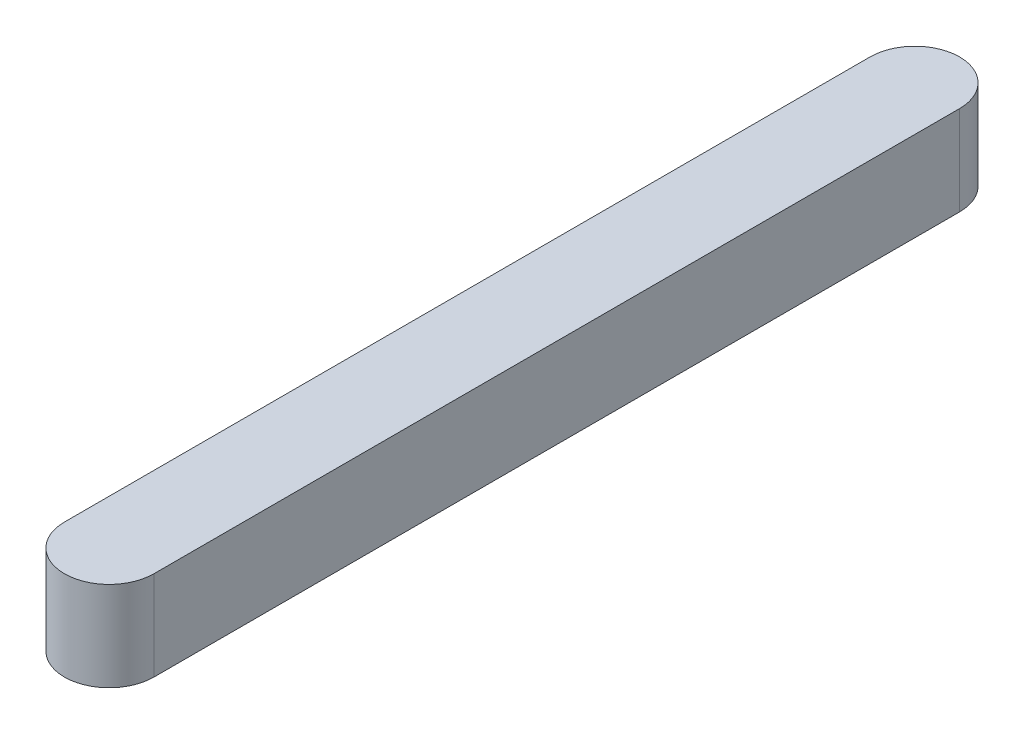
ISO-10303-21;
HEADER;
FILE_DESCRIPTION(('STEP AP214'),'2;1');
FILE_NAME('part.step','',(''),(''),'','','');
FILE_SCHEMA(('AUTOMOTIVE_DESIGN { 1 0 10303 214 1 1 1 1 }'));
ENDSEC;
DATA;
#1=APPLICATION_CONTEXT('core data for automotive mechanical design processes');
#2=APPLICATION_PROTOCOL_DEFINITION('international standard','automotive_design',2000,#1);
#3=PRODUCT_CONTEXT('',#1,'mechanical');
#4=PRODUCT('Part','Part','',(#3));
#5=PRODUCT_RELATED_PRODUCT_CATEGORY('part','',(#4));
#6=PRODUCT_DEFINITION_FORMATION('','',#4);
#7=PRODUCT_DEFINITION_CONTEXT('part definition',#1,'design');
#8=PRODUCT_DEFINITION('design','',#6,#7);
#9=PRODUCT_DEFINITION_SHAPE('','',#8);
#10=(LENGTH_UNIT() NAMED_UNIT(*) SI_UNIT(.MILLI.,.METRE.));
#11=(NAMED_UNIT(*) PLANE_ANGLE_UNIT() SI_UNIT($,.RADIAN.));
#12=(NAMED_UNIT(*) SI_UNIT($,.STERADIAN.) SOLID_ANGLE_UNIT());
#13=UNCERTAINTY_MEASURE_WITH_UNIT(LENGTH_MEASURE(1.E-05),#10,'distance_accuracy_value','');
#14=(GEOMETRIC_REPRESENTATION_CONTEXT(3) GLOBAL_UNCERTAINTY_ASSIGNED_CONTEXT((#13)) GLOBAL_UNIT_ASSIGNED_CONTEXT((#10,
#11,#12)) REPRESENTATION_CONTEXT('',''));
#15=CARTESIAN_POINT('',(0.,0.,0.));
#16=DIRECTION('',(0.,0.,1.));
#17=DIRECTION('',(1.,0.,0.));
#18=AXIS2_PLACEMENT_3D('',#15,#16,#17);
#19=CARTESIAN_POINT('',(0.,1.,9.));
#20=DIRECTION('',(0.,-1.,0.));
#21=DIRECTION('',(0.,0.,-1.));
#22=AXIS2_PLACEMENT_3D('',#19,#20,#21);
#23=CYLINDRICAL_SURFACE('',#22,1.);
#24=CARTESIAN_POINT('',(0.,-1.,9.));
#25=DIRECTION('',(0.,-1.,0.));
#26=DIRECTION('',(0.,0.,-1.));
#27=AXIS2_PLACEMENT_3D('',#24,#25,#26);
#28=CIRCLE('',#27,1.);
#29=CARTESIAN_POINT('',(-1.,-1.,9.));
#30=VERTEX_POINT('',#29);
#31=CARTESIAN_POINT('',(1.,-1.,9.));
#32=VERTEX_POINT('',#31);
#33=EDGE_CURVE('E20',#30,#32,#28,.F.);
#34=ORIENTED_EDGE('',*,*,#33,.T.);
#35=DIRECTION('',(0.,1.,0.));
#36=VECTOR('',#35,1.);
#37=CARTESIAN_POINT('',(1.,-1.,9.));
#38=LINE('',#37,#36);
#39=CARTESIAN_POINT('',(1.,1.,9.));
#40=VERTEX_POINT('',#39);
#41=EDGE_CURVE('E76',#32,#40,#38,.T.);
#42=ORIENTED_EDGE('',*,*,#41,.T.);
#43=CARTESIAN_POINT('',(0.,1.,9.));
#44=DIRECTION('',(0.,-1.,0.));
#45=DIRECTION('',(0.,0.,-1.));
#46=AXIS2_PLACEMENT_3D('',#43,#44,#45);
#47=CIRCLE('',#46,1.);
#48=CARTESIAN_POINT('',(-1.,1.,9.));
#49=VERTEX_POINT('',#48);
#50=EDGE_CURVE('E64',#40,#49,#47,.T.);
#51=ORIENTED_EDGE('',*,*,#50,.T.);
#52=DIRECTION('',(0.,1.,0.));
#53=VECTOR('',#52,1.);
#54=CARTESIAN_POINT('',(-1.,-1.,9.));
#55=LINE('',#54,#53);
#56=EDGE_CURVE('E83',#49,#30,#55,.F.);
#57=ORIENTED_EDGE('',*,*,#56,.T.);
#58=EDGE_LOOP('',(#34,#42,#51,#57));
#59=FACE_BOUND('',#58,.T.);
#60=ADVANCED_FACE('F17',(#59),#23,.T.);
#61=CARTESIAN_POINT('',(0.,-1.,-9.));
#62=DIRECTION('',(0.,1.,0.));
#63=DIRECTION('',(0.,0.,1.));
#64=AXIS2_PLACEMENT_3D('',#61,#62,#63);
#65=CYLINDRICAL_SURFACE('',#64,0.999999999999999);
#66=CARTESIAN_POINT('',(0.,-1.,-9.));
#67=DIRECTION('',(0.,1.,0.));
#68=DIRECTION('',(0.,0.,1.));
#69=AXIS2_PLACEMENT_3D('',#66,#67,#68);
#70=CIRCLE('',#69,0.999999999999999);
#71=CARTESIAN_POINT('',(1.,-1.,-9.));
#72=VERTEX_POINT('',#71);
#73=CARTESIAN_POINT('',(-1.,-1.,-9.));
#74=VERTEX_POINT('',#73);
#75=EDGE_CURVE('E35',#72,#74,#70,.T.);
#76=ORIENTED_EDGE('',*,*,#75,.T.);
#77=DIRECTION('',(0.,1.,0.));
#78=VECTOR('',#77,1.);
#79=CARTESIAN_POINT('',(-1.,-1.,-9.));
#80=LINE('',#79,#78);
#81=CARTESIAN_POINT('',(-1.,1.,-9.));
#82=VERTEX_POINT('',#81);
#83=EDGE_CURVE('E86',#74,#82,#80,.T.);
#84=ORIENTED_EDGE('',*,*,#83,.T.);
#85=CARTESIAN_POINT('',(0.,1.,-9.));
#86=DIRECTION('',(0.,-1.,0.));
#87=DIRECTION('',(0.,0.,-1.));
#88=AXIS2_PLACEMENT_3D('',#85,#86,#87);
#89=CIRCLE('',#88,0.999999999999999);
#90=CARTESIAN_POINT('',(1.,1.,-9.));
#91=VERTEX_POINT('',#90);
#92=EDGE_CURVE('E56',#82,#91,#89,.T.);
#93=ORIENTED_EDGE('',*,*,#92,.T.);
#94=DIRECTION('',(0.,1.,0.));
#95=VECTOR('',#94,1.);
#96=CARTESIAN_POINT('',(1.,-1.,-9.));
#97=LINE('',#96,#95);
#98=EDGE_CURVE('E77',#91,#72,#97,.F.);
#99=ORIENTED_EDGE('',*,*,#98,.T.);
#100=EDGE_LOOP('',(#76,#84,#93,#99));
#101=FACE_BOUND('',#100,.T.);
#102=ADVANCED_FACE('F91',(#101),#65,.T.);
#103=CARTESIAN_POINT('',(-1.,1.,10.));
#104=DIRECTION('',(0.,-1.,0.));
#105=DIRECTION('',(0.,0.,-1.));
#106=AXIS2_PLACEMENT_3D('',#103,#104,#105);
#107=PLANE('',#106);
#108=ORIENTED_EDGE('',*,*,#92,.F.);
#109=DIRECTION('',(0.,0.,-1.));
#110=VECTOR('',#109,1.);
#111=CARTESIAN_POINT('',(-1.,1.,10.));
#112=LINE('',#111,#110);
#113=EDGE_CURVE('E68',#82,#49,#112,.F.);
#114=ORIENTED_EDGE('',*,*,#113,.T.);
#115=ORIENTED_EDGE('',*,*,#50,.F.);
#116=DIRECTION('',(0.,0.,1.));
#117=VECTOR('',#116,1.);
#118=CARTESIAN_POINT('',(1.,1.,10.));
#119=LINE('',#118,#117);
#120=EDGE_CURVE('E67',#40,#91,#119,.F.);
#121=ORIENTED_EDGE('',*,*,#120,.T.);
#122=EDGE_LOOP('',(#108,#114,#115,#121));
#123=FACE_BOUND('',#122,.T.);
#124=ADVANCED_FACE('F66',(#123),#107,.F.);
#125=CARTESIAN_POINT('',(1.,-1.,10.));
#126=DIRECTION('',(-1.,0.,0.));
#127=DIRECTION('',(0.,0.,1.));
#128=AXIS2_PLACEMENT_3D('',#125,#126,#127);
#129=PLANE('',#128);
#130=ORIENTED_EDGE('',*,*,#98,.F.);
#131=ORIENTED_EDGE('',*,*,#120,.F.);
#132=ORIENTED_EDGE('',*,*,#41,.F.);
#133=DIRECTION('',(0.,0.,1.));
#134=VECTOR('',#133,1.);
#135=CARTESIAN_POINT('',(1.,-1.,10.));
#136=LINE('',#135,#134);
#137=EDGE_CURVE('E26',#32,#72,#136,.F.);
#138=ORIENTED_EDGE('',*,*,#137,.T.);
#139=EDGE_LOOP('',(#130,#131,#132,#138));
#140=FACE_BOUND('',#139,.T.);
#141=ADVANCED_FACE('F74',(#140),#129,.F.);
#142=CARTESIAN_POINT('',(-1.,-1.,10.));
#143=DIRECTION('',(1.,0.,0.));
#144=DIRECTION('',(0.,0.,-1.));
#145=AXIS2_PLACEMENT_3D('',#142,#143,#144);
#146=PLANE('',#145);
#147=ORIENTED_EDGE('',*,*,#83,.F.);
#148=DIRECTION('',(0.,0.,1.));
#149=VECTOR('',#148,1.);
#150=CARTESIAN_POINT('',(-1.,-1.,10.));
#151=LINE('',#150,#149);
#152=EDGE_CURVE('E11',#74,#30,#151,.T.);
#153=ORIENTED_EDGE('',*,*,#152,.T.);
#154=ORIENTED_EDGE('',*,*,#56,.F.);
#155=ORIENTED_EDGE('',*,*,#113,.F.);
#156=EDGE_LOOP('',(#147,#153,#154,#155));
#157=FACE_BOUND('',#156,.T.);
#158=ADVANCED_FACE('F89',(#157),#146,.F.);
#159=CARTESIAN_POINT('',(-1.,-1.,10.));
#160=DIRECTION('',(0.,1.,0.));
#161=DIRECTION('',(0.,0.,1.));
#162=AXIS2_PLACEMENT_3D('',#159,#160,#161);
#163=PLANE('',#162);
#164=ORIENTED_EDGE('',*,*,#75,.F.);
#165=ORIENTED_EDGE('',*,*,#137,.F.);
#166=ORIENTED_EDGE('',*,*,#33,.F.);
#167=ORIENTED_EDGE('',*,*,#152,.F.);
#168=EDGE_LOOP('',(#164,#165,#166,#167));
#169=FACE_BOUND('',#168,.T.);
#170=ADVANCED_FACE('F90',(#169),#163,.F.);
#171=CLOSED_SHELL('',(#60,#102,#124,#141,#158,#170));
#172=MANIFOLD_SOLID_BREP('B1',#171);
#173=ADVANCED_BREP_SHAPE_REPRESENTATION('',(#18,#172),#14);
#174=SHAPE_DEFINITION_REPRESENTATION(#9,#173);
ENDSEC;
END-ISO-10303-21;
